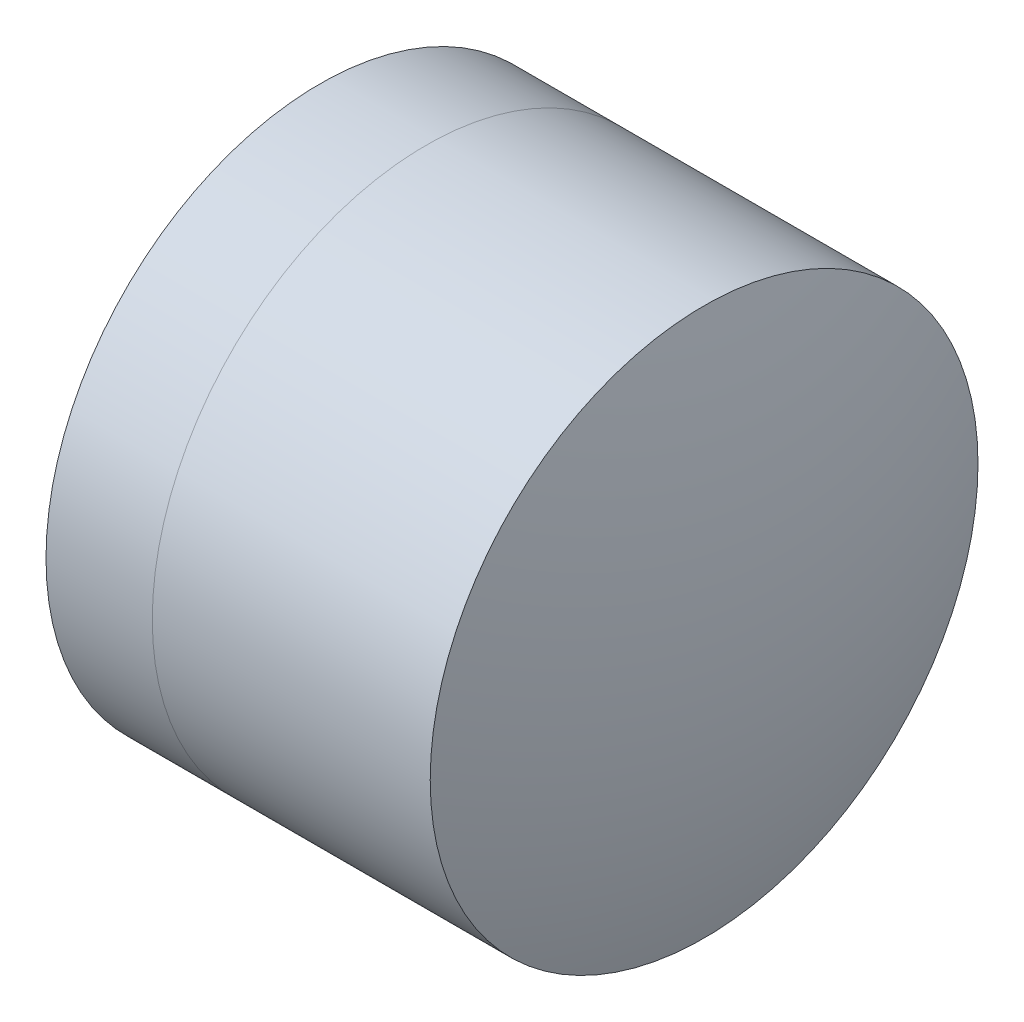
ISO-10303-21;
HEADER;
FILE_DESCRIPTION(('STEP AP214'),'2;1');
FILE_NAME('part.step','',(''),(''),'','','');
FILE_SCHEMA(('AUTOMOTIVE_DESIGN { 1 0 10303 214 1 1 1 1 }'));
ENDSEC;
DATA;
#1=APPLICATION_CONTEXT('core data for automotive mechanical design processes');
#2=APPLICATION_PROTOCOL_DEFINITION('international standard','automotive_design',2000,#1);
#3=PRODUCT_CONTEXT('',#1,'mechanical');
#4=PRODUCT('Part','Part','',(#3));
#5=PRODUCT_RELATED_PRODUCT_CATEGORY('part','',(#4));
#6=PRODUCT_DEFINITION_FORMATION('','',#4);
#7=PRODUCT_DEFINITION_CONTEXT('part definition',#1,'design');
#8=PRODUCT_DEFINITION('design','',#6,#7);
#9=PRODUCT_DEFINITION_SHAPE('','',#8);
#10=(LENGTH_UNIT() NAMED_UNIT(*) SI_UNIT(.MILLI.,.METRE.));
#11=(NAMED_UNIT(*) PLANE_ANGLE_UNIT() SI_UNIT($,.RADIAN.));
#12=(NAMED_UNIT(*) SI_UNIT($,.STERADIAN.) SOLID_ANGLE_UNIT());
#13=UNCERTAINTY_MEASURE_WITH_UNIT(LENGTH_MEASURE(1.E-05),#10,'distance_accuracy_value','');
#14=(GEOMETRIC_REPRESENTATION_CONTEXT(3) GLOBAL_UNCERTAINTY_ASSIGNED_CONTEXT((#13)) GLOBAL_UNIT_ASSIGNED_CONTEXT((#10,
#11,#12)) REPRESENTATION_CONTEXT('',''));
#15=CARTESIAN_POINT('',(0.,0.,0.));
#16=DIRECTION('',(0.,0.,1.));
#17=DIRECTION('',(1.,0.,0.));
#18=AXIS2_PLACEMENT_3D('',#15,#16,#17);
#19=CARTESIAN_POINT('',(1.09460433993269,0.,0.));
#20=DIRECTION('',(-1.,0.,0.));
#21=DIRECTION('',(0.,0.,1.));
#22=AXIS2_PLACEMENT_3D('',#19,#20,#21);
#23=SPHERICAL_SURFACE('',#22,4.14600000000001);
#24=CARTESIAN_POINT('',(3.79030758769571,0.,0.));
#25=DIRECTION('',(-1.,0.,0.));
#26=DIRECTION('',(0.,0.,1.));
#27=AXIS2_PLACEMENT_3D('',#24,#25,#26);
#28=CIRCLE('',#27,3.15);
#29=CARTESIAN_POINT('',(3.79030758769571,0.,3.15));
#30=VERTEX_POINT('',#29);
#31=EDGE_CURVE('E11',#30,#30,#28,.T.);
#32=ORIENTED_EDGE('',*,*,#31,.T.);
#33=EDGE_LOOP('',(#32));
#34=FACE_BOUND('',#33,.T.);
#35=ADVANCED_FACE('F49',(#34),#23,.F.);
#36=CARTESIAN_POINT('',(-0.551919992657797,0.,0.));
#37=DIRECTION('',(-1.,0.,0.));
#38=DIRECTION('',(0.,0.,1.));
#39=AXIS2_PLACEMENT_3D('',#36,#37,#38);
#40=CYLINDRICAL_SURFACE('',#39,3.15);
#41=CARTESIAN_POINT('',(6.98682755534406,0.,0.));
#42=DIRECTION('',(-1.,0.,0.));
#43=DIRECTION('',(0.,0.,1.));
#44=AXIS2_PLACEMENT_3D('',#41,#42,#43);
#45=CIRCLE('',#44,3.15);
#46=CARTESIAN_POINT('',(6.98682755534406,0.,3.15));
#47=VERTEX_POINT('',#46);
#48=EDGE_CURVE('E55',#47,#47,#45,.T.);
#49=ORIENTED_EDGE('',*,*,#48,.T.);
#50=EDGE_LOOP('',(#49));
#51=FACE_BOUND('',#50,.T.);
#52=ORIENTED_EDGE('',*,*,#31,.F.);
#53=EDGE_LOOP('',(#52));
#54=FACE_BOUND('',#53,.T.);
#55=ADVANCED_FACE('F61',(#51,#54),#40,.T.);
#56=CARTESIAN_POINT('',(-2.6093956600673,0.,0.));
#57=DIRECTION('',(-1.,0.,0.));
#58=DIRECTION('',(0.,0.,1.));
#59=AXIS2_PLACEMENT_3D('',#56,#57,#58);
#60=SPHERICAL_SURFACE('',#59,10.1);
#61=ORIENTED_EDGE('',*,*,#48,.F.);
#62=EDGE_LOOP('',(#61));
#63=FACE_BOUND('',#62,.T.);
#64=ADVANCED_FACE('F64',(#63),#60,.T.);
#65=CLOSED_SHELL('',(#35,#55,#64));
#66=MANIFOLD_SOLID_BREP('B2',#65);
#67=CARTESIAN_POINT('',(8.64860433993269,0.,0.));
#68=DIRECTION('',(-1.,0.,0.));
#69=DIRECTION('',(0.,0.,1.));
#70=AXIS2_PLACEMENT_3D('',#67,#68,#69);
#71=SPHERICAL_SURFACE('',#70,6.848);
#72=CARTESIAN_POINT('',(2.56809416396883,0.,0.));
#73=DIRECTION('',(-1.,0.,0.));
#74=DIRECTION('',(0.,0.,1.));
#75=AXIS2_PLACEMENT_3D('',#72,#73,#74);
#76=CIRCLE('',#75,3.15);
#77=CARTESIAN_POINT('',(2.56809416396883,0.,3.15));
#78=VERTEX_POINT('',#77);
#79=EDGE_CURVE('E48',#78,#78,#76,.T.);
#80=ORIENTED_EDGE('',*,*,#79,.T.);
#81=EDGE_LOOP('',(#80));
#82=FACE_BOUND('',#81,.T.);
#83=ADVANCED_FACE('F92',(#82),#71,.T.);
#84=CARTESIAN_POINT('',(-0.816062176165804,0.,0.));
#85=DIRECTION('',(-1.,0.,0.));
#86=DIRECTION('',(0.,0.,1.));
#87=AXIS2_PLACEMENT_3D('',#84,#85,#86);
#88=CYLINDRICAL_SURFACE('',#87,3.15);
#89=CARTESIAN_POINT('',(3.79030758769571,0.,0.));
#90=DIRECTION('',(-1.,0.,0.));
#91=DIRECTION('',(0.,0.,1.));
#92=AXIS2_PLACEMENT_3D('',#89,#90,#91);
#93=CIRCLE('',#92,3.15);
#94=CARTESIAN_POINT('',(3.79030758769571,0.,3.15));
#95=VERTEX_POINT('',#94);
#96=EDGE_CURVE('E98',#95,#95,#93,.T.);
#97=ORIENTED_EDGE('',*,*,#96,.T.);
#98=EDGE_LOOP('',(#97));
#99=FACE_BOUND('',#98,.T.);
#100=ORIENTED_EDGE('',*,*,#79,.F.);
#101=EDGE_LOOP('',(#100));
#102=FACE_BOUND('',#101,.T.);
#103=ADVANCED_FACE('F104',(#99,#102),#88,.T.);
#104=CARTESIAN_POINT('',(1.09460433993269,0.,0.));
#105=DIRECTION('',(-1.,0.,0.));
#106=DIRECTION('',(0.,0.,1.));
#107=AXIS2_PLACEMENT_3D('',#104,#105,#106);
#108=SPHERICAL_SURFACE('',#107,4.14600000000001);
#109=ORIENTED_EDGE('',*,*,#96,.F.);
#110=EDGE_LOOP('',(#109));
#111=FACE_BOUND('',#110,.T.);
#112=ADVANCED_FACE('F107',(#111),#108,.T.);
#113=CLOSED_SHELL('',(#83,#103,#112));
#114=MANIFOLD_SOLID_BREP('B6',#113);
#115=ADVANCED_BREP_SHAPE_REPRESENTATION('',(#18,#66,#114),#14);
#116=SHAPE_DEFINITION_REPRESENTATION(#9,#115);
ENDSEC;
END-ISO-10303-21;
